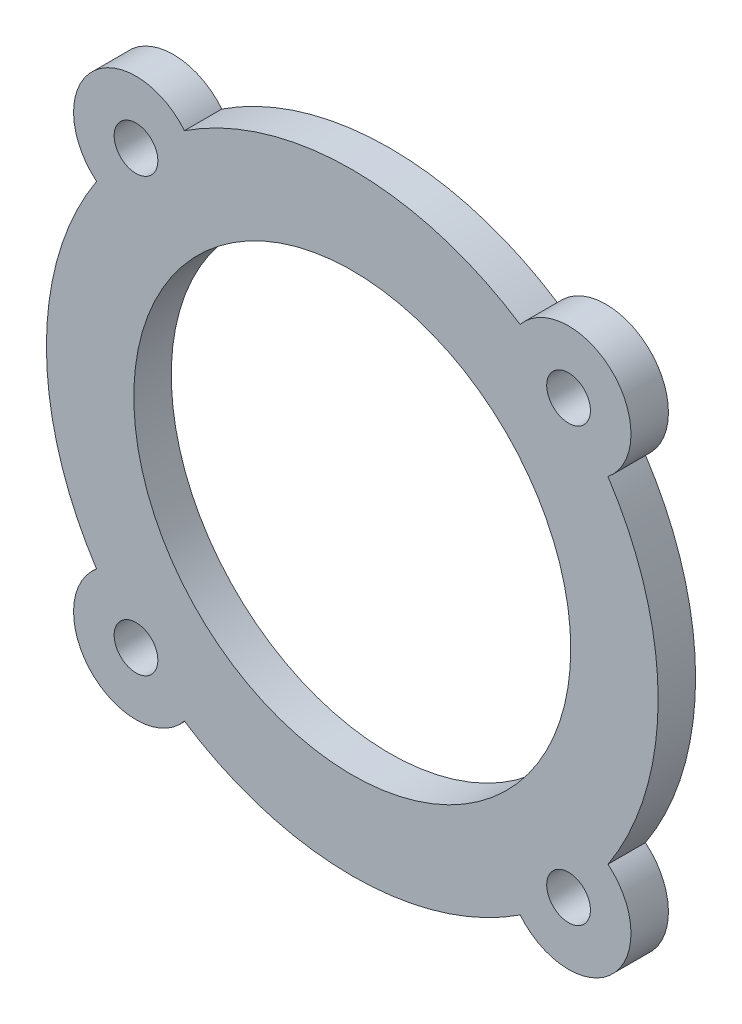
ISO-10303-21;
HEADER;
FILE_DESCRIPTION(('STEP AP214'),'2;1');
FILE_NAME('part.step','',(''),(''),'','','');
FILE_SCHEMA(('AUTOMOTIVE_DESIGN { 1 0 10303 214 1 1 1 1 }'));
ENDSEC;
DATA;
#1=APPLICATION_CONTEXT('core data for automotive mechanical design processes');
#2=APPLICATION_PROTOCOL_DEFINITION('international standard','automotive_design',2000,#1);
#3=PRODUCT_CONTEXT('',#1,'mechanical');
#4=PRODUCT('Part','Part','',(#3));
#5=PRODUCT_RELATED_PRODUCT_CATEGORY('part','',(#4));
#6=PRODUCT_DEFINITION_FORMATION('','',#4);
#7=PRODUCT_DEFINITION_CONTEXT('part definition',#1,'design');
#8=PRODUCT_DEFINITION('design','',#6,#7);
#9=PRODUCT_DEFINITION_SHAPE('','',#8);
#10=(LENGTH_UNIT() NAMED_UNIT(*) SI_UNIT(.MILLI.,.METRE.));
#11=(NAMED_UNIT(*) PLANE_ANGLE_UNIT() SI_UNIT($,.RADIAN.));
#12=(NAMED_UNIT(*) SI_UNIT($,.STERADIAN.) SOLID_ANGLE_UNIT());
#13=UNCERTAINTY_MEASURE_WITH_UNIT(LENGTH_MEASURE(1.E-05),#10,'distance_accuracy_value','');
#14=(GEOMETRIC_REPRESENTATION_CONTEXT(3) GLOBAL_UNCERTAINTY_ASSIGNED_CONTEXT((#13)) GLOBAL_UNIT_ASSIGNED_CONTEXT((#10,
#11,#12)) REPRESENTATION_CONTEXT('',''));
#15=CARTESIAN_POINT('',(0.,0.,0.));
#16=DIRECTION('',(0.,0.,1.));
#17=DIRECTION('',(1.,0.,0.));
#18=AXIS2_PLACEMENT_3D('',#15,#16,#17);
#19=CARTESIAN_POINT('',(-8.66205806953521,8.66205806953521,3.));
#20=DIRECTION('',(0.,0.,1.));
#21=DIRECTION('',(1.,0.,0.));
#22=AXIS2_PLACEMENT_3D('',#19,#20,#21);
#23=PLANE('',#22);
#24=CARTESIAN_POINT('',(17.3241161390701,-17.3241161390692,3.));
#25=DIRECTION('',(0.,0.,1.));
#26=DIRECTION('',(1.,0.,0.));
#27=AXIS2_PLACEMENT_3D('',#24,#25,#26);
#28=CIRCLE('',#27,1.75000000000017);
#29=CARTESIAN_POINT('',(19.0741161390703,-17.3241161390692,3.));
#30=VERTEX_POINT('',#29);
#31=EDGE_CURVE('E195',#30,#30,#28,.T.);
#32=ORIENTED_EDGE('',*,*,#31,.F.);
#33=EDGE_LOOP('',(#32));
#34=FACE_BOUND('',#33,.T.);
#35=CARTESIAN_POINT('',(-17.3241161390704,17.3241161390704,3.));
#36=DIRECTION('',(0.,0.,1.));
#37=DIRECTION('',(1.,0.,0.));
#38=AXIS2_PLACEMENT_3D('',#35,#36,#37);
#39=CIRCLE('',#38,1.75);
#40=CARTESIAN_POINT('',(-15.5741161390704,17.3241161390704,3.));
#41=VERTEX_POINT('',#40);
#42=EDGE_CURVE('E183',#41,#41,#39,.T.);
#43=ORIENTED_EDGE('',*,*,#42,.F.);
#44=EDGE_LOOP('',(#43));
#45=FACE_BOUND('',#44,.T.);
#46=CARTESIAN_POINT('',(0.,0.,3.));
#47=DIRECTION('',(0.,0.,1.));
#48=DIRECTION('',(1.,0.,0.));
#49=AXIS2_PLACEMENT_3D('',#46,#47,#48);
#50=CIRCLE('',#49,24.5);
#51=CARTESIAN_POINT('',(13.4462682018077,20.4804265445096,3.));
#52=VERTEX_POINT('',#51);
#53=CARTESIAN_POINT('',(-13.4462682018091,20.4804265445087,3.));
#54=VERTEX_POINT('',#53);
#55=EDGE_CURVE('E146',#52,#54,#50,.T.);
#56=ORIENTED_EDGE('',*,*,#55,.T.);
#57=CARTESIAN_POINT('',(-17.3241161390704,17.3241161390704,3.));
#58=DIRECTION('',(0.,0.,1.));
#59=DIRECTION('',(1.,0.,0.));
#60=AXIS2_PLACEMENT_3D('',#57,#58,#59);
#61=CIRCLE('',#60,5.);
#62=CARTESIAN_POINT('',(-20.4804265445087,13.4462682018091,3.));
#63=VERTEX_POINT('',#62);
#64=EDGE_CURVE('E94',#54,#63,#61,.T.);
#65=ORIENTED_EDGE('',*,*,#64,.T.);
#66=CARTESIAN_POINT('',(0.,0.,3.));
#67=DIRECTION('',(0.,0.,1.));
#68=DIRECTION('',(1.,0.,0.));
#69=AXIS2_PLACEMENT_3D('',#66,#67,#68);
#70=CIRCLE('',#69,24.5);
#71=CARTESIAN_POINT('',(-20.4804265445085,-13.4462682018095,3.));
#72=VERTEX_POINT('',#71);
#73=EDGE_CURVE('E161',#63,#72,#70,.T.);
#74=ORIENTED_EDGE('',*,*,#73,.T.);
#75=CARTESIAN_POINT('',(-17.3241161390688,-17.3241161390697,3.));
#76=DIRECTION('',(0.,0.,1.));
#77=DIRECTION('',(1.,0.,0.));
#78=AXIS2_PLACEMENT_3D('',#75,#76,#77);
#79=CIRCLE('',#78,4.99999999999996);
#80=CARTESIAN_POINT('',(-13.4462682018085,-20.4804265445091,3.));
#81=VERTEX_POINT('',#80);
#82=EDGE_CURVE('E174',#72,#81,#79,.T.);
#83=ORIENTED_EDGE('',*,*,#82,.T.);
#84=CARTESIAN_POINT('',(0.,0.,3.));
#85=DIRECTION('',(0.,0.,1.));
#86=DIRECTION('',(1.,0.,0.));
#87=AXIS2_PLACEMENT_3D('',#84,#85,#86);
#88=CIRCLE('',#87,24.5);
#89=CARTESIAN_POINT('',(13.4462682018109,-20.4804265445075,3.));
#90=VERTEX_POINT('',#89);
#91=EDGE_CURVE('E113',#81,#90,#88,.T.);
#92=ORIENTED_EDGE('',*,*,#91,.T.);
#93=CARTESIAN_POINT('',(17.3241161390713,-17.324116139068,3.));
#94=DIRECTION('',(0.,0.,1.));
#95=DIRECTION('',(1.,0.,0.));
#96=AXIS2_PLACEMENT_3D('',#93,#94,#95);
#97=CIRCLE('',#96,4.99999999999995);
#98=CARTESIAN_POINT('',(20.48042654451,-13.4462682018071,3.));
#99=VERTEX_POINT('',#98);
#100=EDGE_CURVE('E107',#90,#99,#97,.T.);
#101=ORIENTED_EDGE('',*,*,#100,.T.);
#102=CARTESIAN_POINT('',(0.,0.,3.));
#103=DIRECTION('',(0.,0.,1.));
#104=DIRECTION('',(1.,0.,0.));
#105=AXIS2_PLACEMENT_3D('',#102,#103,#104);
#106=CIRCLE('',#105,24.5);
#107=CARTESIAN_POINT('',(20.4804265445078,13.4462682018106,3.));
#108=VERTEX_POINT('',#107);
#109=EDGE_CURVE('E111',#99,#108,#106,.T.);
#110=ORIENTED_EDGE('',*,*,#109,.T.);
#111=CARTESIAN_POINT('',(17.3241161390696,17.324116139072,3.));
#112=DIRECTION('',(0.,0.,1.));
#113=DIRECTION('',(1.,0.,0.));
#114=AXIS2_PLACEMENT_3D('',#111,#112,#113);
#115=CIRCLE('',#114,5.);
#116=EDGE_CURVE('E51',#108,#52,#115,.T.);
#117=ORIENTED_EDGE('',*,*,#116,.T.);
#118=EDGE_LOOP('',(#56,#65,#74,#83,#92,#101,#110,#117));
#119=FACE_BOUND('',#118,.T.);
#120=CARTESIAN_POINT('',(0.,0.,3.));
#121=DIRECTION('',(0.,0.,1.));
#122=DIRECTION('',(1.,0.,0.));
#123=AXIS2_PLACEMENT_3D('',#120,#121,#122);
#124=CIRCLE('',#123,17.5);
#125=CARTESIAN_POINT('',(17.5,0.,3.));
#126=VERTEX_POINT('',#125);
#127=EDGE_CURVE('E135',#126,#126,#124,.T.);
#128=ORIENTED_EDGE('',*,*,#127,.F.);
#129=EDGE_LOOP('',(#128));
#130=FACE_BOUND('',#129,.T.);
#131=CARTESIAN_POINT('',(17.3241161390696,17.3241161390709,3.));
#132=DIRECTION('',(0.,0.,1.));
#133=DIRECTION('',(1.,0.,0.));
#134=AXIS2_PLACEMENT_3D('',#131,#132,#133);
#135=CIRCLE('',#134,1.75000000000072);
#136=CARTESIAN_POINT('',(19.0741161390704,17.3241161390709,3.));
#137=VERTEX_POINT('',#136);
#138=EDGE_CURVE('E189',#137,#137,#135,.T.);
#139=ORIENTED_EDGE('',*,*,#138,.F.);
#140=EDGE_LOOP('',(#139));
#141=FACE_BOUND('',#140,.T.);
#142=CARTESIAN_POINT('',(-17.32411613907,-17.3241161390697,3.));
#143=DIRECTION('',(0.,0.,1.));
#144=DIRECTION('',(1.,0.,0.));
#145=AXIS2_PLACEMENT_3D('',#142,#143,#144);
#146=CIRCLE('',#145,1.74999999999962);
#147=CARTESIAN_POINT('',(-15.5741161390704,-17.3241161390697,3.));
#148=VERTEX_POINT('',#147);
#149=EDGE_CURVE('E201',#148,#148,#146,.T.);
#150=ORIENTED_EDGE('',*,*,#149,.F.);
#151=EDGE_LOOP('',(#150));
#152=FACE_BOUND('',#151,.T.);
#153=ADVANCED_FACE('F34',(#34,#45,#119,#130,#141,#152),#23,.T.);
#154=CARTESIAN_POINT('',(-8.66205806953521,8.66205806953521,0.));
#155=DIRECTION('',(0.,0.,1.));
#156=DIRECTION('',(1.,0.,0.));
#157=AXIS2_PLACEMENT_3D('',#154,#155,#156);
#158=PLANE('',#157);
#159=CARTESIAN_POINT('',(0.,0.,0.));
#160=DIRECTION('',(0.,0.,1.));
#161=DIRECTION('',(1.,0.,0.));
#162=AXIS2_PLACEMENT_3D('',#159,#160,#161);
#163=CIRCLE('',#162,24.5);
#164=CARTESIAN_POINT('',(13.4462682018077,20.4804265445096,0.));
#165=VERTEX_POINT('',#164);
#166=CARTESIAN_POINT('',(-13.4462682018091,20.4804265445087,0.));
#167=VERTEX_POINT('',#166);
#168=EDGE_CURVE('E131',#165,#167,#163,.T.);
#169=ORIENTED_EDGE('',*,*,#168,.F.);
#170=CARTESIAN_POINT('',(17.3241161390696,17.324116139072,0.));
#171=DIRECTION('',(0.,0.,1.));
#172=DIRECTION('',(1.,0.,0.));
#173=AXIS2_PLACEMENT_3D('',#170,#171,#172);
#174=CIRCLE('',#173,5.);
#175=CARTESIAN_POINT('',(20.4804265445078,13.4462682018106,0.));
#176=VERTEX_POINT('',#175);
#177=EDGE_CURVE('E86',#176,#165,#174,.T.);
#178=ORIENTED_EDGE('',*,*,#177,.F.);
#179=CARTESIAN_POINT('',(0.,0.,0.));
#180=DIRECTION('',(0.,0.,1.));
#181=DIRECTION('',(1.,0.,0.));
#182=AXIS2_PLACEMENT_3D('',#179,#180,#181);
#183=CIRCLE('',#182,24.5);
#184=CARTESIAN_POINT('',(20.48042654451,-13.4462682018071,0.));
#185=VERTEX_POINT('',#184);
#186=EDGE_CURVE('E80',#185,#176,#183,.T.);
#187=ORIENTED_EDGE('',*,*,#186,.F.);
#188=CARTESIAN_POINT('',(17.3241161390713,-17.324116139068,0.));
#189=DIRECTION('',(0.,0.,1.));
#190=DIRECTION('',(1.,0.,0.));
#191=AXIS2_PLACEMENT_3D('',#188,#189,#190);
#192=CIRCLE('',#191,4.99999999999995);
#193=CARTESIAN_POINT('',(13.4462682018109,-20.4804265445075,0.));
#194=VERTEX_POINT('',#193);
#195=EDGE_CURVE('E121',#194,#185,#192,.T.);
#196=ORIENTED_EDGE('',*,*,#195,.F.);
#197=CARTESIAN_POINT('',(0.,0.,0.));
#198=DIRECTION('',(0.,0.,1.));
#199=DIRECTION('',(1.,0.,0.));
#200=AXIS2_PLACEMENT_3D('',#197,#198,#199);
#201=CIRCLE('',#200,24.5);
#202=CARTESIAN_POINT('',(-13.4462682018085,-20.4804265445091,0.));
#203=VERTEX_POINT('',#202);
#204=EDGE_CURVE('E141',#203,#194,#201,.T.);
#205=ORIENTED_EDGE('',*,*,#204,.F.);
#206=CARTESIAN_POINT('',(-17.3241161390688,-17.3241161390697,0.));
#207=DIRECTION('',(0.,0.,1.));
#208=DIRECTION('',(1.,0.,0.));
#209=AXIS2_PLACEMENT_3D('',#206,#207,#208);
#210=CIRCLE('',#209,4.99999999999996);
#211=CARTESIAN_POINT('',(-20.4804265445085,-13.4462682018095,0.));
#212=VERTEX_POINT('',#211);
#213=EDGE_CURVE('E139',#212,#203,#210,.T.);
#214=ORIENTED_EDGE('',*,*,#213,.F.);
#215=CARTESIAN_POINT('',(0.,0.,0.));
#216=DIRECTION('',(0.,0.,1.));
#217=DIRECTION('',(1.,0.,0.));
#218=AXIS2_PLACEMENT_3D('',#215,#216,#217);
#219=CIRCLE('',#218,24.5);
#220=CARTESIAN_POINT('',(-20.4804265445087,13.4462682018091,0.));
#221=VERTEX_POINT('',#220);
#222=EDGE_CURVE('E137',#221,#212,#219,.T.);
#223=ORIENTED_EDGE('',*,*,#222,.F.);
#224=CARTESIAN_POINT('',(-17.3241161390704,17.3241161390704,0.));
#225=DIRECTION('',(0.,0.,1.));
#226=DIRECTION('',(1.,0.,0.));
#227=AXIS2_PLACEMENT_3D('',#224,#225,#226);
#228=CIRCLE('',#227,5.);
#229=EDGE_CURVE('E134',#167,#221,#228,.T.);
#230=ORIENTED_EDGE('',*,*,#229,.F.);
#231=EDGE_LOOP('',(#169,#178,#187,#196,#205,#214,#223,#230));
#232=FACE_BOUND('',#231,.T.);
#233=CARTESIAN_POINT('',(0.,0.,0.));
#234=DIRECTION('',(0.,0.,1.));
#235=DIRECTION('',(1.,0.,0.));
#236=AXIS2_PLACEMENT_3D('',#233,#234,#235);
#237=CIRCLE('',#236,17.5);
#238=CARTESIAN_POINT('',(17.5,0.,0.));
#239=VERTEX_POINT('',#238);
#240=EDGE_CURVE('E180',#239,#239,#237,.T.);
#241=ORIENTED_EDGE('',*,*,#240,.T.);
#242=EDGE_LOOP('',(#241));
#243=FACE_BOUND('',#242,.T.);
#244=CARTESIAN_POINT('',(-17.3241161390704,17.3241161390704,0.));
#245=DIRECTION('',(0.,0.,1.));
#246=DIRECTION('',(1.,0.,0.));
#247=AXIS2_PLACEMENT_3D('',#244,#245,#246);
#248=CIRCLE('',#247,1.75);
#249=CARTESIAN_POINT('',(-15.5741161390704,17.3241161390704,0.));
#250=VERTEX_POINT('',#249);
#251=EDGE_CURVE('E186',#250,#250,#248,.T.);
#252=ORIENTED_EDGE('',*,*,#251,.T.);
#253=EDGE_LOOP('',(#252));
#254=FACE_BOUND('',#253,.T.);
#255=CARTESIAN_POINT('',(17.3241161390696,17.3241161390709,0.));
#256=DIRECTION('',(0.,0.,1.));
#257=DIRECTION('',(1.,0.,0.));
#258=AXIS2_PLACEMENT_3D('',#255,#256,#257);
#259=CIRCLE('',#258,1.75000000000072);
#260=CARTESIAN_POINT('',(19.0741161390704,17.3241161390709,0.));
#261=VERTEX_POINT('',#260);
#262=EDGE_CURVE('E192',#261,#261,#259,.T.);
#263=ORIENTED_EDGE('',*,*,#262,.T.);
#264=EDGE_LOOP('',(#263));
#265=FACE_BOUND('',#264,.T.);
#266=CARTESIAN_POINT('',(17.3241161390701,-17.3241161390692,0.));
#267=DIRECTION('',(0.,0.,1.));
#268=DIRECTION('',(1.,0.,0.));
#269=AXIS2_PLACEMENT_3D('',#266,#267,#268);
#270=CIRCLE('',#269,1.75000000000017);
#271=CARTESIAN_POINT('',(19.0741161390703,-17.3241161390692,0.));
#272=VERTEX_POINT('',#271);
#273=EDGE_CURVE('E198',#272,#272,#270,.T.);
#274=ORIENTED_EDGE('',*,*,#273,.T.);
#275=EDGE_LOOP('',(#274));
#276=FACE_BOUND('',#275,.T.);
#277=CARTESIAN_POINT('',(-17.32411613907,-17.3241161390697,0.));
#278=DIRECTION('',(0.,0.,1.));
#279=DIRECTION('',(1.,0.,0.));
#280=AXIS2_PLACEMENT_3D('',#277,#278,#279);
#281=CIRCLE('',#280,1.74999999999962);
#282=CARTESIAN_POINT('',(-15.5741161390704,-17.3241161390697,0.));
#283=VERTEX_POINT('',#282);
#284=EDGE_CURVE('E204',#283,#283,#281,.T.);
#285=ORIENTED_EDGE('',*,*,#284,.T.);
#286=EDGE_LOOP('',(#285));
#287=FACE_BOUND('',#286,.T.);
#288=ADVANCED_FACE('F165',(#232,#243,#254,#265,#276,#287),#158,.F.);
#289=CARTESIAN_POINT('',(0.,0.,3.));
#290=DIRECTION('',(0.,0.,-1.));
#291=DIRECTION('',(-1.,0.,0.));
#292=AXIS2_PLACEMENT_3D('',#289,#290,#291);
#293=CYLINDRICAL_SURFACE('',#292,24.5);
#294=ORIENTED_EDGE('',*,*,#168,.T.);
#295=DIRECTION('',(0.,0.,-1.));
#296=VECTOR('',#295,1.);
#297=CARTESIAN_POINT('',(-13.4462682018091,20.4804265445087,3.));
#298=LINE('',#297,#296);
#299=EDGE_CURVE('E11',#54,#167,#298,.T.);
#300=ORIENTED_EDGE('',*,*,#299,.F.);
#301=ORIENTED_EDGE('',*,*,#55,.F.);
#302=DIRECTION('',(0.,0.,-1.));
#303=VECTOR('',#302,1.);
#304=CARTESIAN_POINT('',(13.4462682018077,20.4804265445096,3.));
#305=LINE('',#304,#303);
#306=EDGE_CURVE('E127',#52,#165,#305,.T.);
#307=ORIENTED_EDGE('',*,*,#306,.T.);
#308=EDGE_LOOP('',(#294,#300,#301,#307));
#309=FACE_BOUND('',#308,.T.);
#310=ADVANCED_FACE('F36',(#309),#293,.T.);
#311=CARTESIAN_POINT('',(-17.3241161390704,17.3241161390704,3.));
#312=DIRECTION('',(0.,0.,-1.));
#313=DIRECTION('',(-1.,0.,0.));
#314=AXIS2_PLACEMENT_3D('',#311,#312,#313);
#315=CYLINDRICAL_SURFACE('',#314,5.);
#316=ORIENTED_EDGE('',*,*,#229,.T.);
#317=DIRECTION('',(0.,0.,-1.));
#318=VECTOR('',#317,1.);
#319=CARTESIAN_POINT('',(-20.4804265445087,13.4462682018091,3.));
#320=LINE('',#319,#318);
#321=EDGE_CURVE('E43',#63,#221,#320,.T.);
#322=ORIENTED_EDGE('',*,*,#321,.F.);
#323=ORIENTED_EDGE('',*,*,#64,.F.);
#324=ORIENTED_EDGE('',*,*,#299,.T.);
#325=EDGE_LOOP('',(#316,#322,#323,#324));
#326=FACE_BOUND('',#325,.T.);
#327=ADVANCED_FACE('F238',(#326),#315,.T.);
#328=CARTESIAN_POINT('',(0.,0.,3.));
#329=DIRECTION('',(0.,0.,-1.));
#330=DIRECTION('',(-1.,0.,0.));
#331=AXIS2_PLACEMENT_3D('',#328,#329,#330);
#332=CYLINDRICAL_SURFACE('',#331,24.5);
#333=ORIENTED_EDGE('',*,*,#222,.T.);
#334=DIRECTION('',(0.,0.,-1.));
#335=VECTOR('',#334,1.);
#336=CARTESIAN_POINT('',(-20.4804265445085,-13.4462682018095,3.));
#337=LINE('',#336,#335);
#338=EDGE_CURVE('E153',#72,#212,#337,.T.);
#339=ORIENTED_EDGE('',*,*,#338,.F.);
#340=ORIENTED_EDGE('',*,*,#73,.F.);
#341=ORIENTED_EDGE('',*,*,#321,.T.);
#342=EDGE_LOOP('',(#333,#339,#340,#341));
#343=FACE_BOUND('',#342,.T.);
#344=ADVANCED_FACE('F159',(#343),#332,.T.);
#345=CARTESIAN_POINT('',(-17.3241161390688,-17.3241161390697,3.));
#346=DIRECTION('',(0.,0.,-1.));
#347=DIRECTION('',(-1.,0.,0.));
#348=AXIS2_PLACEMENT_3D('',#345,#346,#347);
#349=CYLINDRICAL_SURFACE('',#348,4.99999999999996);
#350=ORIENTED_EDGE('',*,*,#213,.T.);
#351=DIRECTION('',(0.,0.,-1.));
#352=VECTOR('',#351,1.);
#353=CARTESIAN_POINT('',(-13.4462682018085,-20.4804265445091,3.));
#354=LINE('',#353,#352);
#355=EDGE_CURVE('E150',#81,#203,#354,.T.);
#356=ORIENTED_EDGE('',*,*,#355,.F.);
#357=ORIENTED_EDGE('',*,*,#82,.F.);
#358=ORIENTED_EDGE('',*,*,#338,.T.);
#359=EDGE_LOOP('',(#350,#356,#357,#358));
#360=FACE_BOUND('',#359,.T.);
#361=ADVANCED_FACE('F170',(#360),#349,.T.);
#362=CARTESIAN_POINT('',(0.,0.,3.));
#363=DIRECTION('',(0.,0.,-1.));
#364=DIRECTION('',(-1.,0.,0.));
#365=AXIS2_PLACEMENT_3D('',#362,#363,#364);
#366=CYLINDRICAL_SURFACE('',#365,24.5);
#367=ORIENTED_EDGE('',*,*,#204,.T.);
#368=DIRECTION('',(0.,0.,-1.));
#369=VECTOR('',#368,1.);
#370=CARTESIAN_POINT('',(13.4462682018109,-20.4804265445075,3.));
#371=LINE('',#370,#369);
#372=EDGE_CURVE('E122',#90,#194,#371,.T.);
#373=ORIENTED_EDGE('',*,*,#372,.F.);
#374=ORIENTED_EDGE('',*,*,#91,.F.);
#375=ORIENTED_EDGE('',*,*,#355,.T.);
#376=EDGE_LOOP('',(#367,#373,#374,#375));
#377=FACE_BOUND('',#376,.T.);
#378=ADVANCED_FACE('F173',(#377),#366,.T.);
#379=CARTESIAN_POINT('',(17.3241161390713,-17.324116139068,3.));
#380=DIRECTION('',(0.,0.,-1.));
#381=DIRECTION('',(-1.,0.,0.));
#382=AXIS2_PLACEMENT_3D('',#379,#380,#381);
#383=CYLINDRICAL_SURFACE('',#382,4.99999999999995);
#384=ORIENTED_EDGE('',*,*,#195,.T.);
#385=DIRECTION('',(0.,0.,-1.));
#386=VECTOR('',#385,1.);
#387=CARTESIAN_POINT('',(20.48042654451,-13.4462682018071,3.));
#388=LINE('',#387,#386);
#389=EDGE_CURVE('E118',#99,#185,#388,.T.);
#390=ORIENTED_EDGE('',*,*,#389,.F.);
#391=ORIENTED_EDGE('',*,*,#100,.F.);
#392=ORIENTED_EDGE('',*,*,#372,.T.);
#393=EDGE_LOOP('',(#384,#390,#391,#392));
#394=FACE_BOUND('',#393,.T.);
#395=ADVANCED_FACE('F119',(#394),#383,.T.);
#396=CARTESIAN_POINT('',(0.,0.,3.));
#397=DIRECTION('',(0.,0.,-1.));
#398=DIRECTION('',(-1.,0.,0.));
#399=AXIS2_PLACEMENT_3D('',#396,#397,#398);
#400=CYLINDRICAL_SURFACE('',#399,24.5);
#401=ORIENTED_EDGE('',*,*,#186,.T.);
#402=DIRECTION('',(0.,0.,-1.));
#403=VECTOR('',#402,1.);
#404=CARTESIAN_POINT('',(20.4804265445078,13.4462682018106,3.));
#405=LINE('',#404,#403);
#406=EDGE_CURVE('E123',#108,#176,#405,.T.);
#407=ORIENTED_EDGE('',*,*,#406,.F.);
#408=ORIENTED_EDGE('',*,*,#109,.F.);
#409=ORIENTED_EDGE('',*,*,#389,.T.);
#410=EDGE_LOOP('',(#401,#407,#408,#409));
#411=FACE_BOUND('',#410,.T.);
#412=ADVANCED_FACE('F125',(#411),#400,.T.);
#413=CARTESIAN_POINT('',(17.3241161390696,17.324116139072,3.));
#414=DIRECTION('',(0.,0.,-1.));
#415=DIRECTION('',(-1.,0.,0.));
#416=AXIS2_PLACEMENT_3D('',#413,#414,#415);
#417=CYLINDRICAL_SURFACE('',#416,5.);
#418=ORIENTED_EDGE('',*,*,#177,.T.);
#419=ORIENTED_EDGE('',*,*,#306,.F.);
#420=ORIENTED_EDGE('',*,*,#116,.F.);
#421=ORIENTED_EDGE('',*,*,#406,.T.);
#422=EDGE_LOOP('',(#418,#419,#420,#421));
#423=FACE_BOUND('',#422,.T.);
#424=ADVANCED_FACE('F226',(#423),#417,.T.);
#425=CARTESIAN_POINT('',(0.,0.,3.));
#426=DIRECTION('',(0.,0.,-1.));
#427=DIRECTION('',(-1.,0.,0.));
#428=AXIS2_PLACEMENT_3D('',#425,#426,#427);
#429=CYLINDRICAL_SURFACE('',#428,17.5);
#430=ORIENTED_EDGE('',*,*,#127,.T.);
#431=EDGE_LOOP('',(#430));
#432=FACE_BOUND('',#431,.T.);
#433=ORIENTED_EDGE('',*,*,#240,.F.);
#434=EDGE_LOOP('',(#433));
#435=FACE_BOUND('',#434,.T.);
#436=ADVANCED_FACE('F223',(#432,#435),#429,.F.);
#437=CARTESIAN_POINT('',(-17.3241161390704,17.3241161390704,3.));
#438=DIRECTION('',(0.,0.,-1.));
#439=DIRECTION('',(-1.,0.,0.));
#440=AXIS2_PLACEMENT_3D('',#437,#438,#439);
#441=CYLINDRICAL_SURFACE('',#440,1.75);
#442=ORIENTED_EDGE('',*,*,#42,.T.);
#443=EDGE_LOOP('',(#442));
#444=FACE_BOUND('',#443,.T.);
#445=ORIENTED_EDGE('',*,*,#251,.F.);
#446=EDGE_LOOP('',(#445));
#447=FACE_BOUND('',#446,.T.);
#448=ADVANCED_FACE('F302',(#444,#447),#441,.F.);
#449=CARTESIAN_POINT('',(17.3241161390696,17.3241161390709,3.));
#450=DIRECTION('',(0.,0.,-1.));
#451=DIRECTION('',(-1.,0.,0.));
#452=AXIS2_PLACEMENT_3D('',#449,#450,#451);
#453=CYLINDRICAL_SURFACE('',#452,1.75000000000072);
#454=ORIENTED_EDGE('',*,*,#138,.T.);
#455=EDGE_LOOP('',(#454));
#456=FACE_BOUND('',#455,.T.);
#457=ORIENTED_EDGE('',*,*,#262,.F.);
#458=EDGE_LOOP('',(#457));
#459=FACE_BOUND('',#458,.T.);
#460=ADVANCED_FACE('F310',(#456,#459),#453,.F.);
#461=CARTESIAN_POINT('',(17.3241161390701,-17.3241161390692,3.));
#462=DIRECTION('',(0.,0.,-1.));
#463=DIRECTION('',(-1.,0.,0.));
#464=AXIS2_PLACEMENT_3D('',#461,#462,#463);
#465=CYLINDRICAL_SURFACE('',#464,1.75000000000017);
#466=ORIENTED_EDGE('',*,*,#31,.T.);
#467=EDGE_LOOP('',(#466));
#468=FACE_BOUND('',#467,.T.);
#469=ORIENTED_EDGE('',*,*,#273,.F.);
#470=EDGE_LOOP('',(#469));
#471=FACE_BOUND('',#470,.T.);
#472=ADVANCED_FACE('F318',(#468,#471),#465,.F.);
#473=CARTESIAN_POINT('',(-17.32411613907,-17.3241161390697,3.));
#474=DIRECTION('',(0.,0.,-1.));
#475=DIRECTION('',(-1.,0.,0.));
#476=AXIS2_PLACEMENT_3D('',#473,#474,#475);
#477=CYLINDRICAL_SURFACE('',#476,1.74999999999962);
#478=ORIENTED_EDGE('',*,*,#149,.T.);
#479=EDGE_LOOP('',(#478));
#480=FACE_BOUND('',#479,.T.);
#481=ORIENTED_EDGE('',*,*,#284,.F.);
#482=EDGE_LOOP('',(#481));
#483=FACE_BOUND('',#482,.T.);
#484=ADVANCED_FACE('F210',(#480,#483),#477,.F.);
#485=CLOSED_SHELL('',(#153,#288,#310,#327,#344,#361,#378,#395,#412,#424,#436,#448,#460,#472,#484));
#486=MANIFOLD_SOLID_BREP('B2',#485);
#487=ADVANCED_BREP_SHAPE_REPRESENTATION('',(#18,#486),#14);
#488=SHAPE_DEFINITION_REPRESENTATION(#9,#487);
ENDSEC;
END-ISO-10303-21;
